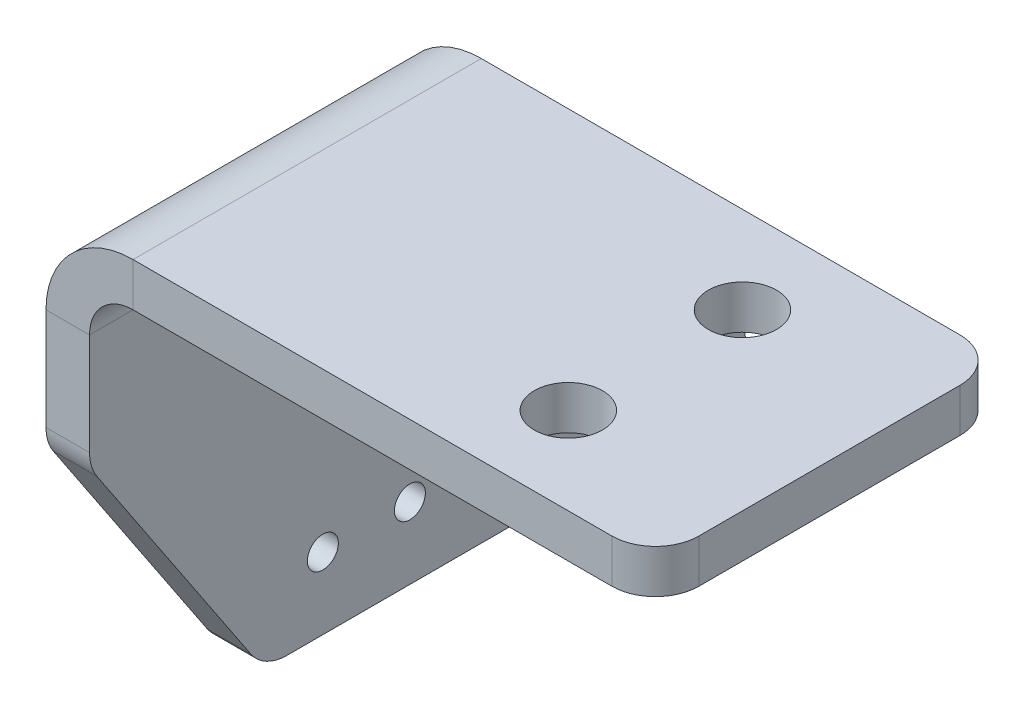
ISO-10303-21;
HEADER;
FILE_DESCRIPTION(('STEP AP214'),'2;1');
FILE_NAME('part.step','',(''),(''),'','','');
FILE_SCHEMA(('AUTOMOTIVE_DESIGN { 1 0 10303 214 1 1 1 1 }'));
ENDSEC;
DATA;
#1=APPLICATION_CONTEXT('core data for automotive mechanical design processes');
#2=APPLICATION_PROTOCOL_DEFINITION('international standard','automotive_design',2000,#1);
#3=PRODUCT_CONTEXT('',#1,'mechanical');
#4=PRODUCT('Part','Part','',(#3));
#5=PRODUCT_RELATED_PRODUCT_CATEGORY('part','',(#4));
#6=PRODUCT_DEFINITION_FORMATION('','',#4);
#7=PRODUCT_DEFINITION_CONTEXT('part definition',#1,'design');
#8=PRODUCT_DEFINITION('design','',#6,#7);
#9=PRODUCT_DEFINITION_SHAPE('','',#8);
#10=(LENGTH_UNIT() NAMED_UNIT(*) SI_UNIT(.MILLI.,.METRE.));
#11=(NAMED_UNIT(*) PLANE_ANGLE_UNIT() SI_UNIT($,.RADIAN.));
#12=(NAMED_UNIT(*) SI_UNIT($,.STERADIAN.) SOLID_ANGLE_UNIT());
#13=UNCERTAINTY_MEASURE_WITH_UNIT(LENGTH_MEASURE(1.E-05),#10,'distance_accuracy_value','');
#14=(GEOMETRIC_REPRESENTATION_CONTEXT(3) GLOBAL_UNCERTAINTY_ASSIGNED_CONTEXT((#13)) GLOBAL_UNIT_ASSIGNED_CONTEXT((#10,
#11,#12)) REPRESENTATION_CONTEXT('',''));
#15=CARTESIAN_POINT('',(0.,0.,0.));
#16=DIRECTION('',(0.,0.,1.));
#17=DIRECTION('',(1.,0.,0.));
#18=AXIS2_PLACEMENT_3D('',#15,#16,#17);
#19=CARTESIAN_POINT('',(-3.17500000000003,1.13091750636071,0.));
#20=DIRECTION('',(0.,0.,-1.));
#21=DIRECTION('',(0.,-1.,0.));
#22=AXIS2_PLACEMENT_3D('',#19,#20,#21);
#23=PLANE('',#22);
#24=DIRECTION('',(0.,-1.,0.));
#25=VECTOR('',#24,1.);
#26=CARTESIAN_POINT('',(-3.17500000000003,1.13091750636071,0.));
#27=LINE('',#26,#25);
#28=CARTESIAN_POINT('',(-3.17500000000002,-3.17500000000002,0.));
#29=VERTEX_POINT('',#28);
#30=CARTESIAN_POINT('',(-3.17499999999999,-10.6077698438402,0.));
#31=VERTEX_POINT('',#30);
#32=EDGE_CURVE('E200',#29,#31,#27,.T.);
#33=ORIENTED_EDGE('',*,*,#32,.T.);
#34=DIRECTION('',(1.,0.,0.));
#35=VECTOR('',#34,1.);
#36=CARTESIAN_POINT('',(-3.17499999999999,-10.6077698438402,0.));
#37=LINE('',#36,#35);
#38=CARTESIAN_POINT('',(0.,-10.6077698438402,0.));
#39=VERTEX_POINT('',#38);
#40=EDGE_CURVE('E289',#31,#39,#37,.T.);
#41=ORIENTED_EDGE('',*,*,#40,.T.);
#42=DIRECTION('',(0.,1.,0.));
#43=VECTOR('',#42,1.);
#44=CARTESIAN_POINT('',(0.,1.13091750636072,0.));
#45=LINE('',#44,#43);
#46=CARTESIAN_POINT('',(0.,-3.17500000000001,0.));
#47=VERTEX_POINT('',#46);
#48=EDGE_CURVE('E212',#47,#39,#45,.F.);
#49=ORIENTED_EDGE('',*,*,#48,.F.);
#50=DIRECTION('',(-1.,0.,0.));
#51=VECTOR('',#50,1.);
#52=CARTESIAN_POINT('',(-3.17500000000002,-3.17500000000002,0.));
#53=LINE('',#52,#51);
#54=EDGE_CURVE('E186',#47,#29,#53,.T.);
#55=ORIENTED_EDGE('',*,*,#54,.T.);
#56=EDGE_LOOP('',(#33,#41,#49,#55));
#57=FACE_BOUND('',#56,.T.);
#58=ADVANCED_FACE('F50',(#57),#23,.F.);
#59=CARTESIAN_POINT('',(-3.17500000000004,1.13091750636071,-25.4));
#60=DIRECTION('',(0.,0.,1.));
#61=DIRECTION('',(0.,1.,0.));
#62=AXIS2_PLACEMENT_3D('',#59,#60,#61);
#63=PLANE('',#62);
#64=DIRECTION('',(0.,1.,0.));
#65=VECTOR('',#64,1.);
#66=CARTESIAN_POINT('',(0.,1.13091750636072,-25.4));
#67=LINE('',#66,#65);
#68=CARTESIAN_POINT('',(0.,-18.5540824936393,-25.4));
#69=VERTEX_POINT('',#68);
#70=CARTESIAN_POINT('',(0.,-3.17500000000001,-25.4));
#71=VERTEX_POINT('',#70);
#72=EDGE_CURVE('E225',#69,#71,#67,.T.);
#73=ORIENTED_EDGE('',*,*,#72,.F.);
#74=DIRECTION('',(1.,0.,0.));
#75=VECTOR('',#74,1.);
#76=CARTESIAN_POINT('',(-3.17499999999997,-18.5540824936393,-25.4));
#77=LINE('',#76,#75);
#78=CARTESIAN_POINT('',(-3.17499999999997,-18.5540824936393,-25.4));
#79=VERTEX_POINT('',#78);
#80=EDGE_CURVE('E302',#69,#79,#77,.F.);
#81=ORIENTED_EDGE('',*,*,#80,.T.);
#82=DIRECTION('',(0.,1.,0.));
#83=VECTOR('',#82,1.);
#84=CARTESIAN_POINT('',(-3.17500000000004,1.13091750636071,-25.4));
#85=LINE('',#84,#83);
#86=CARTESIAN_POINT('',(-3.17500000000002,-3.17500000000002,-25.4));
#87=VERTEX_POINT('',#86);
#88=EDGE_CURVE('E187',#79,#87,#85,.T.);
#89=ORIENTED_EDGE('',*,*,#88,.T.);
#90=DIRECTION('',(1.,0.,0.));
#91=VECTOR('',#90,1.);
#92=CARTESIAN_POINT('',(-3.17500000000002,-3.17500000000002,-25.4));
#93=LINE('',#92,#91);
#94=EDGE_CURVE('E217',#87,#71,#93,.T.);
#95=ORIENTED_EDGE('',*,*,#94,.T.);
#96=EDGE_LOOP('',(#73,#81,#89,#95));
#97=FACE_BOUND('',#96,.T.);
#98=ADVANCED_FACE('F305',(#97),#63,.F.);
#99=CARTESIAN_POINT('',(-3.17500000000003,1.13091750636071,0.));
#100=DIRECTION('',(-1.,0.,0.));
#101=DIRECTION('',(0.,0.,1.));
#102=AXIS2_PLACEMENT_3D('',#99,#100,#101);
#103=PLANE('',#102);
#104=DIRECTION('',(0.,0.,-1.));
#105=VECTOR('',#104,1.);
#106=CARTESIAN_POINT('',(-3.17500000000016,-21.7290824936393,-25.4));
#107=LINE('',#106,#105);
#108=CARTESIAN_POINT('',(-3.17500000000016,-21.7290824936393,-28.575));
#109=VERTEX_POINT('',#108);
#110=CARTESIAN_POINT('',(-3.17500000000017,-21.7290824936393,-42.8795605736339));
#111=VERTEX_POINT('',#110);
#112=EDGE_CURVE('E315',#109,#111,#107,.T.);
#113=ORIENTED_EDGE('',*,*,#112,.T.);
#114=CARTESIAN_POINT('',(-3.17499999999995,-24.9040824936393,-42.8795605736339));
#115=DIRECTION('',(-1.,0.,0.));
#116=DIRECTION('',(0.,-1.,0.));
#117=AXIS2_PLACEMENT_3D('',#114,#115,#116);
#118=CIRCLE('',#117,3.175);
#119=CARTESIAN_POINT('',(-3.17499999999996,-23.0731133412636,-45.4734335394995));
#120=VERTEX_POINT('',#119);
#121=EDGE_CURVE('E297',#111,#120,#118,.T.);
#122=ORIENTED_EDGE('',*,*,#121,.T.);
#123=DIRECTION('',(0.,-0.816967863264762,-0.576683197598655));
#124=VECTOR('',#123,1.);
#125=CARTESIAN_POINT('',(-3.17500000000008,14.5055133493168,-18.9473441108545));
#126=LINE('',#125,#124);
#127=CARTESIAN_POINT('',(-3.17499999999995,-25.6131133412636,-47.2663747159701));
#128=VERTEX_POINT('',#127);
#129=EDGE_CURVE('E227',#120,#128,#126,.T.);
#130=ORIENTED_EDGE('',*,*,#129,.T.);
#131=CARTESIAN_POINT('',(-3.17499999999994,-27.4440824936393,-44.6725017501045));
#132=DIRECTION('',(-1.,0.,0.));
#133=DIRECTION('',(0.,-1.,0.));
#134=AXIS2_PLACEMENT_3D('',#131,#132,#133);
#135=CIRCLE('',#134,3.175);
#136=CARTESIAN_POINT('',(-3.17499999999993,-30.6190824936393,-44.6725017501045));
#137=VERTEX_POINT('',#136);
#138=EDGE_CURVE('E267',#128,#137,#135,.T.);
#139=ORIENTED_EDGE('',*,*,#138,.T.);
#140=DIRECTION('',(0.,0.,-1.));
#141=VECTOR('',#140,1.);
#142=CARTESIAN_POINT('',(-3.17499999999992,-30.6190824936393,0.));
#143=LINE('',#142,#141);
#144=CARTESIAN_POINT('',(-3.17499999999993,-30.6190824936393,-14.3992084331994));
#145=VERTEX_POINT('',#144);
#146=EDGE_CURVE('E378',#145,#137,#143,.T.);
#147=ORIENTED_EDGE('',*,*,#146,.F.);
#148=CARTESIAN_POINT('',(-3.17499999999994,-27.4440824936393,-14.3992084331994));
#149=DIRECTION('',(-1.,0.,0.));
#150=DIRECTION('',(0.,-1.,0.));
#151=AXIS2_PLACEMENT_3D('',#148,#149,#150);
#152=CIRCLE('',#151,3.175);
#153=CARTESIAN_POINT('',(-3.17499999999993,-29.2052556166544,-11.7574487486767));
#154=VERTEX_POINT('',#153);
#155=EDGE_CURVE('E265',#145,#154,#152,.T.);
#156=ORIENTED_EDGE('',*,*,#155,.T.);
#157=DIRECTION('',(0.,-0.832050294337843,-0.554700196225229));
#158=VECTOR('',#157,1.);
#159=CARTESIAN_POINT('',(-3.17500000000002,-2.77677480133161,5.86153846153847));
#160=LINE('',#159,#158);
#161=CARTESIAN_POINT('',(-3.17499999999999,-12.3689429668553,-0.533240315477345));
#162=VERTEX_POINT('',#161);
#163=EDGE_CURVE('E208',#162,#154,#160,.T.);
#164=ORIENTED_EDGE('',*,*,#163,.F.);
#165=CARTESIAN_POINT('',(-3.17499999999999,-10.6077698438402,-3.175));
#166=DIRECTION('',(-1.,0.,0.));
#167=DIRECTION('',(0.,-1.,0.));
#168=AXIS2_PLACEMENT_3D('',#165,#166,#167);
#169=CIRCLE('',#168,3.175);
#170=EDGE_CURVE('E205',#162,#31,#169,.T.);
#171=ORIENTED_EDGE('',*,*,#170,.T.);
#172=ORIENTED_EDGE('',*,*,#32,.F.);
#173=DIRECTION('',(0.,0.,-1.));
#174=VECTOR('',#173,1.);
#175=CARTESIAN_POINT('',(-3.17500000000002,-3.17500000000002,0.));
#176=LINE('',#175,#174);
#177=EDGE_CURVE('E175',#29,#87,#176,.T.);
#178=ORIENTED_EDGE('',*,*,#177,.T.);
#179=ORIENTED_EDGE('',*,*,#88,.F.);
#180=CARTESIAN_POINT('',(-3.17499999999997,-18.5540824936393,-28.575));
#181=DIRECTION('',(-1.,0.,0.));
#182=DIRECTION('',(0.,-1.,0.));
#183=AXIS2_PLACEMENT_3D('',#180,#181,#182);
#184=CIRCLE('',#183,3.175);
#185=EDGE_CURVE('E12',#79,#109,#184,.F.);
#186=ORIENTED_EDGE('',*,*,#185,.T.);
#187=EDGE_LOOP('',(#113,#122,#130,#139,#147,#156,#164,#171,#172,#178,#179,#186));
#188=FACE_BOUND('',#187,.T.);
#189=CARTESIAN_POINT('',(-3.17500000000012,-25.3999999999998,-17.018));
#190=DIRECTION('',(-1.,0.,0.));
#191=DIRECTION('',(0.,-1.,0.));
#192=AXIS2_PLACEMENT_3D('',#189,#190,#191);
#193=CIRCLE('',#192,1.1303);
#194=CARTESIAN_POINT('',(-3.17500000000013,-26.5302999999998,-17.018));
#195=VERTEX_POINT('',#194);
#196=EDGE_CURVE('E234',#195,#195,#193,.T.);
#197=ORIENTED_EDGE('',*,*,#196,.F.);
#198=EDGE_LOOP('',(#197));
#199=FACE_BOUND('',#198,.T.);
#200=CARTESIAN_POINT('',(-3.17500000000012,-25.3999999999998,-23.368));
#201=DIRECTION('',(-1.,0.,0.));
#202=DIRECTION('',(0.,-1.,0.));
#203=AXIS2_PLACEMENT_3D('',#200,#201,#202);
#204=CIRCLE('',#203,1.1303);
#205=CARTESIAN_POINT('',(-3.17500000000013,-26.5302999999998,-23.368));
#206=VERTEX_POINT('',#205);
#207=EDGE_CURVE('E324',#206,#206,#204,.T.);
#208=ORIENTED_EDGE('',*,*,#207,.F.);
#209=EDGE_LOOP('',(#208));
#210=FACE_BOUND('',#209,.T.);
#211=CARTESIAN_POINT('',(-3.17500000000012,-25.3999999999999,-29.718));
#212=DIRECTION('',(-1.,0.,0.));
#213=DIRECTION('',(0.,-1.,0.));
#214=AXIS2_PLACEMENT_3D('',#211,#212,#213);
#215=CIRCLE('',#214,1.1303);
#216=CARTESIAN_POINT('',(-3.17500000000013,-26.5302999999999,-29.718));
#217=VERTEX_POINT('',#216);
#218=EDGE_CURVE('E327',#217,#217,#215,.T.);
#219=ORIENTED_EDGE('',*,*,#218,.F.);
#220=EDGE_LOOP('',(#219));
#221=FACE_BOUND('',#220,.T.);
#222=CARTESIAN_POINT('',(-3.17500000000012,-25.3999999999999,-36.068));
#223=DIRECTION('',(-1.,0.,0.));
#224=DIRECTION('',(0.,-1.,0.));
#225=AXIS2_PLACEMENT_3D('',#222,#223,#224);
#226=CIRCLE('',#225,1.1303);
#227=CARTESIAN_POINT('',(-3.17500000000013,-26.5302999999999,-36.068));
#228=VERTEX_POINT('',#227);
#229=EDGE_CURVE('E330',#228,#228,#226,.T.);
#230=ORIENTED_EDGE('',*,*,#229,.F.);
#231=EDGE_LOOP('',(#230));
#232=FACE_BOUND('',#231,.T.);
#233=CARTESIAN_POINT('',(-3.17500000000012,-25.4,-42.418));
#234=DIRECTION('',(-1.,0.,0.));
#235=DIRECTION('',(0.,-1.,0.));
#236=AXIS2_PLACEMENT_3D('',#233,#234,#235);
#237=CIRCLE('',#236,1.1303);
#238=CARTESIAN_POINT('',(-3.17500000000013,-26.5303,-42.418));
#239=VERTEX_POINT('',#238);
#240=EDGE_CURVE('E319',#239,#239,#237,.T.);
#241=ORIENTED_EDGE('',*,*,#240,.F.);
#242=EDGE_LOOP('',(#241));
#243=FACE_BOUND('',#242,.T.);
#244=ADVANCED_FACE('F202',(#188,#199,#210,#221,#232,#243),#103,.T.);
#245=CARTESIAN_POINT('',(-3.17499999999992,-30.6190824936393,0.));
#246=DIRECTION('',(0.,1.,0.));
#247=DIRECTION('',(0.,0.,-1.));
#248=AXIS2_PLACEMENT_3D('',#245,#246,#247);
#249=PLANE('',#248);
#250=ORIENTED_EDGE('',*,*,#146,.T.);
#251=DIRECTION('',(-1.,0.,0.));
#252=VECTOR('',#251,1.);
#253=CARTESIAN_POINT('',(-3.17499999999993,-30.6190824936393,-44.6725017501045));
#254=LINE('',#253,#252);
#255=CARTESIAN_POINT('',(0.,-30.6190824936393,-44.6725017501045));
#256=VERTEX_POINT('',#255);
#257=EDGE_CURVE('E282',#137,#256,#254,.F.);
#258=ORIENTED_EDGE('',*,*,#257,.T.);
#259=DIRECTION('',(0.,0.,1.));
#260=VECTOR('',#259,1.);
#261=CARTESIAN_POINT('',(0.,-30.6190824936393,0.));
#262=LINE('',#261,#260);
#263=CARTESIAN_POINT('',(0.,-30.6190824936393,-14.3992084331994));
#264=VERTEX_POINT('',#263);
#265=EDGE_CURVE('E385',#264,#256,#262,.F.);
#266=ORIENTED_EDGE('',*,*,#265,.F.);
#267=DIRECTION('',(1.,0.,0.));
#268=VECTOR('',#267,1.);
#269=CARTESIAN_POINT('',(-3.17499999999993,-30.6190824936393,-14.3992084331994));
#270=LINE('',#269,#268);
#271=EDGE_CURVE('E279',#264,#145,#270,.F.);
#272=ORIENTED_EDGE('',*,*,#271,.T.);
#273=EDGE_LOOP('',(#250,#258,#266,#272));
#274=FACE_BOUND('',#273,.T.);
#275=ADVANCED_FACE('F397',(#274),#249,.F.);
#276=CARTESIAN_POINT('',(-3.17500000000002,-2.77677480133161,5.86153846153847));
#277=DIRECTION('',(0.,0.554700196225229,-0.832050294337843));
#278=DIRECTION('',(0.,-0.832050294337843,-0.554700196225229));
#279=AXIS2_PLACEMENT_3D('',#276,#277,#278);
#280=PLANE('',#279);
#281=ORIENTED_EDGE('',*,*,#163,.T.);
#282=DIRECTION('',(1.,0.,0.));
#283=VECTOR('',#282,1.);
#284=CARTESIAN_POINT('',(-3.17499999999993,-29.2052556166544,-11.7574487486767));
#285=LINE('',#284,#283);
#286=CARTESIAN_POINT('',(0.,-29.2052556166544,-11.7574487486767));
#287=VERTEX_POINT('',#286);
#288=EDGE_CURVE('E287',#154,#287,#285,.T.);
#289=ORIENTED_EDGE('',*,*,#288,.T.);
#290=DIRECTION('',(0.,-0.832050294337843,-0.554700196225229));
#291=VECTOR('',#290,1.);
#292=CARTESIAN_POINT('',(0.,-2.77677480133159,5.86153846153847));
#293=LINE('',#292,#291);
#294=CARTESIAN_POINT('',(0.,-12.3689429668553,-0.533240315477346));
#295=VERTEX_POINT('',#294);
#296=EDGE_CURVE('E228',#295,#287,#293,.T.);
#297=ORIENTED_EDGE('',*,*,#296,.F.);
#298=DIRECTION('',(1.,0.,0.));
#299=VECTOR('',#298,1.);
#300=CARTESIAN_POINT('',(-3.17499999999999,-12.3689429668553,-0.533240315477345));
#301=LINE('',#300,#299);
#302=EDGE_CURVE('E284',#295,#162,#301,.F.);
#303=ORIENTED_EDGE('',*,*,#302,.T.);
#304=EDGE_LOOP('',(#281,#289,#297,#303));
#305=FACE_BOUND('',#304,.T.);
#306=ADVANCED_FACE('F404',(#305),#280,.F.);
#307=CARTESIAN_POINT('',(-3.17500000000008,14.5055133493168,-18.9473441108545));
#308=DIRECTION('',(0.,0.576683197598655,-0.816967863264762));
#309=DIRECTION('',(0.,-0.816967863264762,-0.576683197598655));
#310=AXIS2_PLACEMENT_3D('',#307,#308,#309);
#311=PLANE('',#310);
#312=ORIENTED_EDGE('',*,*,#129,.F.);
#313=DIRECTION('',(-1.,0.,0.));
#314=VECTOR('',#313,1.);
#315=CARTESIAN_POINT('',(0.,-23.0731133412635,-45.4734335394995));
#316=LINE('',#315,#314);
#317=CARTESIAN_POINT('',(0.,-23.0731133412635,-45.4734335394995));
#318=VERTEX_POINT('',#317);
#319=EDGE_CURVE('E72',#120,#318,#316,.F.);
#320=ORIENTED_EDGE('',*,*,#319,.T.);
#321=DIRECTION('',(0.,-0.816967863264762,-0.576683197598655));
#322=VECTOR('',#321,1.);
#323=CARTESIAN_POINT('',(0.,14.5055133493168,-18.9473441108545));
#324=LINE('',#323,#322);
#325=CARTESIAN_POINT('',(0.,-25.6131133412636,-47.2663747159701));
#326=VERTEX_POINT('',#325);
#327=EDGE_CURVE('E343',#318,#326,#324,.T.);
#328=ORIENTED_EDGE('',*,*,#327,.T.);
#329=DIRECTION('',(1.,0.,0.));
#330=VECTOR('',#329,1.);
#331=CARTESIAN_POINT('',(-3.17499999999995,-25.6131133412636,-47.2663747159701));
#332=LINE('',#331,#330);
#333=EDGE_CURVE('E269',#326,#128,#332,.F.);
#334=ORIENTED_EDGE('',*,*,#333,.T.);
#335=EDGE_LOOP('',(#312,#320,#328,#334));
#336=FACE_BOUND('',#335,.T.);
#337=ADVANCED_FACE('F387',(#336),#311,.T.);
#338=CARTESIAN_POINT('',(0.,1.13091750636072,0.));
#339=DIRECTION('',(-1.,0.,0.));
#340=DIRECTION('',(0.,0.,1.));
#341=AXIS2_PLACEMENT_3D('',#338,#339,#340);
#342=PLANE('',#341);
#343=CARTESIAN_POINT('',(0.,-25.3999999999998,-17.018));
#344=DIRECTION('',(-1.,0.,0.));
#345=DIRECTION('',(0.,-1.,0.));
#346=AXIS2_PLACEMENT_3D('',#343,#344,#345);
#347=CIRCLE('',#346,1.1303);
#348=CARTESIAN_POINT('',(0.,-26.5302999999998,-17.018));
#349=VERTEX_POINT('',#348);
#350=EDGE_CURVE('E243',#349,#349,#347,.T.);
#351=ORIENTED_EDGE('',*,*,#350,.T.);
#352=EDGE_LOOP('',(#351));
#353=FACE_BOUND('',#352,.T.);
#354=CARTESIAN_POINT('',(0.,-25.3999999999999,-23.368));
#355=DIRECTION('',(-1.,0.,0.));
#356=DIRECTION('',(0.,-1.,0.));
#357=AXIS2_PLACEMENT_3D('',#354,#355,#356);
#358=CIRCLE('',#357,1.1303);
#359=CARTESIAN_POINT('',(0.,-26.5302999999999,-23.368));
#360=VERTEX_POINT('',#359);
#361=EDGE_CURVE('E240',#360,#360,#358,.T.);
#362=ORIENTED_EDGE('',*,*,#361,.T.);
#363=EDGE_LOOP('',(#362));
#364=FACE_BOUND('',#363,.T.);
#365=CARTESIAN_POINT('',(0.,-25.3999999999999,-29.718));
#366=DIRECTION('',(-1.,0.,0.));
#367=DIRECTION('',(0.,-1.,0.));
#368=AXIS2_PLACEMENT_3D('',#365,#366,#367);
#369=CIRCLE('',#368,1.1303);
#370=CARTESIAN_POINT('',(0.,-26.5302999999999,-29.718));
#371=VERTEX_POINT('',#370);
#372=EDGE_CURVE('E237',#371,#371,#369,.T.);
#373=ORIENTED_EDGE('',*,*,#372,.T.);
#374=EDGE_LOOP('',(#373));
#375=FACE_BOUND('',#374,.T.);
#376=CARTESIAN_POINT('',(0.,-25.3999999999999,-36.068));
#377=DIRECTION('',(-1.,0.,0.));
#378=DIRECTION('',(0.,-1.,0.));
#379=AXIS2_PLACEMENT_3D('',#376,#377,#378);
#380=CIRCLE('',#379,1.1303);
#381=CARTESIAN_POINT('',(0.,-26.5302999999999,-36.068));
#382=VERTEX_POINT('',#381);
#383=EDGE_CURVE('E233',#382,#382,#380,.T.);
#384=ORIENTED_EDGE('',*,*,#383,.T.);
#385=EDGE_LOOP('',(#384));
#386=FACE_BOUND('',#385,.T.);
#387=CARTESIAN_POINT('',(0.,-25.4,-42.418));
#388=DIRECTION('',(-1.,0.,0.));
#389=DIRECTION('',(0.,-1.,0.));
#390=AXIS2_PLACEMENT_3D('',#387,#388,#389);
#391=CIRCLE('',#390,1.1303);
#392=CARTESIAN_POINT('',(0.,-26.5303,-42.418));
#393=VERTEX_POINT('',#392);
#394=EDGE_CURVE('E230',#393,#393,#391,.T.);
#395=ORIENTED_EDGE('',*,*,#394,.T.);
#396=EDGE_LOOP('',(#395));
#397=FACE_BOUND('',#396,.T.);
#398=ORIENTED_EDGE('',*,*,#327,.F.);
#399=CARTESIAN_POINT('',(0.,-24.9040824936393,-42.8795605736339));
#400=DIRECTION('',(-1.,0.,0.));
#401=DIRECTION('',(0.,-1.,0.));
#402=AXIS2_PLACEMENT_3D('',#399,#400,#401);
#403=CIRCLE('',#402,3.175);
#404=CARTESIAN_POINT('',(0.,-21.7290824936393,-42.8795605736339));
#405=VERTEX_POINT('',#404);
#406=EDGE_CURVE('E300',#318,#405,#403,.F.);
#407=ORIENTED_EDGE('',*,*,#406,.T.);
#408=DIRECTION('',(0.,0.,-1.));
#409=VECTOR('',#408,1.);
#410=CARTESIAN_POINT('',(0.,-21.7290824936393,-25.4));
#411=LINE('',#410,#409);
#412=CARTESIAN_POINT('',(0.,-21.7290824936393,-28.575));
#413=VERTEX_POINT('',#412);
#414=EDGE_CURVE('E313',#413,#405,#411,.T.);
#415=ORIENTED_EDGE('',*,*,#414,.F.);
#416=CARTESIAN_POINT('',(0.,-18.5540824936393,-28.575));
#417=DIRECTION('',(-1.,0.,0.));
#418=DIRECTION('',(0.,-1.,0.));
#419=AXIS2_PLACEMENT_3D('',#416,#417,#418);
#420=CIRCLE('',#419,3.175);
#421=EDGE_CURVE('E58',#413,#69,#420,.T.);
#422=ORIENTED_EDGE('',*,*,#421,.T.);
#423=ORIENTED_EDGE('',*,*,#72,.T.);
#424=DIRECTION('',(0.,0.,-1.));
#425=VECTOR('',#424,1.);
#426=CARTESIAN_POINT('',(0.,-3.17500000000001,0.));
#427=LINE('',#426,#425);
#428=EDGE_CURVE('E214',#47,#71,#427,.T.);
#429=ORIENTED_EDGE('',*,*,#428,.F.);
#430=ORIENTED_EDGE('',*,*,#48,.T.);
#431=CARTESIAN_POINT('',(0.,-10.6077698438402,-3.175));
#432=DIRECTION('',(-1.,0.,0.));
#433=DIRECTION('',(0.,-1.,0.));
#434=AXIS2_PLACEMENT_3D('',#431,#432,#433);
#435=CIRCLE('',#434,3.175);
#436=EDGE_CURVE('E272',#39,#295,#435,.F.);
#437=ORIENTED_EDGE('',*,*,#436,.T.);
#438=ORIENTED_EDGE('',*,*,#296,.T.);
#439=CARTESIAN_POINT('',(0.,-27.4440824936393,-14.3992084331994));
#440=DIRECTION('',(-1.,0.,0.));
#441=DIRECTION('',(0.,-1.,0.));
#442=AXIS2_PLACEMENT_3D('',#439,#440,#441);
#443=CIRCLE('',#442,3.175);
#444=EDGE_CURVE('E274',#287,#264,#443,.F.);
#445=ORIENTED_EDGE('',*,*,#444,.T.);
#446=ORIENTED_EDGE('',*,*,#265,.T.);
#447=CARTESIAN_POINT('',(0.,-27.4440824936393,-44.6725017501045));
#448=DIRECTION('',(-1.,0.,0.));
#449=DIRECTION('',(0.,-1.,0.));
#450=AXIS2_PLACEMENT_3D('',#447,#448,#449);
#451=CIRCLE('',#450,3.175);
#452=EDGE_CURVE('E276',#256,#326,#451,.F.);
#453=ORIENTED_EDGE('',*,*,#452,.T.);
#454=EDGE_LOOP('',(#398,#407,#415,#422,#423,#429,#430,#437,#438,#445,#446,#453));
#455=FACE_BOUND('',#454,.T.);
#456=ADVANCED_FACE('F316',(#353,#364,#375,#386,#397,#455),#342,.F.);
#457=CARTESIAN_POINT('',(28.575,3.175,-6.35));
#458=DIRECTION('',(0.,1.,0.));
#459=DIRECTION('',(0.,0.,1.));
#460=AXIS2_PLACEMENT_3D('',#457,#458,#459);
#461=CYLINDRICAL_SURFACE('',#460,2.4892);
#462=CARTESIAN_POINT('',(28.575,3.175,-6.35));
#463=DIRECTION('',(0.,1.,0.));
#464=DIRECTION('',(0.,0.,1.));
#465=AXIS2_PLACEMENT_3D('',#462,#463,#464);
#466=CIRCLE('',#465,2.4892);
#467=CARTESIAN_POINT('',(28.575,3.175,-3.8608));
#468=VERTEX_POINT('',#467);
#469=EDGE_CURVE('E369',#468,#468,#466,.T.);
#470=ORIENTED_EDGE('',*,*,#469,.T.);
#471=EDGE_LOOP('',(#470));
#472=FACE_BOUND('',#471,.T.);
#473=CARTESIAN_POINT('',(28.575,0.,-6.35));
#474=DIRECTION('',(0.,1.,0.));
#475=DIRECTION('',(0.,0.,1.));
#476=AXIS2_PLACEMENT_3D('',#473,#474,#475);
#477=CIRCLE('',#476,2.4892);
#478=CARTESIAN_POINT('',(28.575,0.,-3.8608));
#479=VERTEX_POINT('',#478);
#480=EDGE_CURVE('E352',#479,#479,#477,.T.);
#481=ORIENTED_EDGE('',*,*,#480,.F.);
#482=EDGE_LOOP('',(#481));
#483=FACE_BOUND('',#482,.T.);
#484=ADVANCED_FACE('F464',(#472,#483),#461,.F.);
#485=CARTESIAN_POINT('',(28.575,3.175,-19.05));
#486=DIRECTION('',(0.,1.,0.));
#487=DIRECTION('',(0.,0.,1.));
#488=AXIS2_PLACEMENT_3D('',#485,#486,#487);
#489=CYLINDRICAL_SURFACE('',#488,2.4892);
#490=CARTESIAN_POINT('',(28.575,3.175,-19.05));
#491=DIRECTION('',(0.,1.,0.));
#492=DIRECTION('',(0.,0.,1.));
#493=AXIS2_PLACEMENT_3D('',#490,#491,#492);
#494=CIRCLE('',#493,2.4892);
#495=CARTESIAN_POINT('',(28.575,3.175,-16.5608));
#496=VERTEX_POINT('',#495);
#497=EDGE_CURVE('E366',#496,#496,#494,.T.);
#498=ORIENTED_EDGE('',*,*,#497,.T.);
#499=EDGE_LOOP('',(#498));
#500=FACE_BOUND('',#499,.T.);
#501=CARTESIAN_POINT('',(28.575,0.,-19.05));
#502=DIRECTION('',(0.,1.,0.));
#503=DIRECTION('',(0.,0.,1.));
#504=AXIS2_PLACEMENT_3D('',#501,#502,#503);
#505=CIRCLE('',#504,2.4892);
#506=CARTESIAN_POINT('',(28.575,0.,-16.5608));
#507=VERTEX_POINT('',#506);
#508=EDGE_CURVE('E355',#507,#507,#505,.T.);
#509=ORIENTED_EDGE('',*,*,#508,.F.);
#510=EDGE_LOOP('',(#509));
#511=FACE_BOUND('',#510,.T.);
#512=ADVANCED_FACE('F516',(#500,#511),#489,.F.);
#513=CARTESIAN_POINT('',(41.275,3.175,0.));
#514=DIRECTION('',(1.,0.,0.));
#515=DIRECTION('',(0.,0.,-1.));
#516=AXIS2_PLACEMENT_3D('',#513,#514,#515);
#517=PLANE('',#516);
#518=DIRECTION('',(0.,0.,-1.));
#519=VECTOR('',#518,1.);
#520=CARTESIAN_POINT('',(41.275,3.175,0.));
#521=LINE('',#520,#519);
#522=CARTESIAN_POINT('',(41.275,3.175,-3.175));
#523=VERTEX_POINT('',#522);
#524=CARTESIAN_POINT('',(41.275,3.175,-22.225));
#525=VERTEX_POINT('',#524);
#526=EDGE_CURVE('E360',#523,#525,#521,.T.);
#527=ORIENTED_EDGE('',*,*,#526,.F.);
#528=DIRECTION('',(0.,-1.,0.));
#529=VECTOR('',#528,1.);
#530=CARTESIAN_POINT('',(41.275,3.175,-3.175));
#531=LINE('',#530,#529);
#532=CARTESIAN_POINT('',(41.275,0.,-3.175));
#533=VERTEX_POINT('',#532);
#534=EDGE_CURVE('E256',#523,#533,#531,.T.);
#535=ORIENTED_EDGE('',*,*,#534,.T.);
#536=DIRECTION('',(0.,0.,1.));
#537=VECTOR('',#536,1.);
#538=CARTESIAN_POINT('',(41.275,0.,0.));
#539=LINE('',#538,#537);
#540=CARTESIAN_POINT('',(41.275,0.,-22.225));
#541=VERTEX_POINT('',#540);
#542=EDGE_CURVE('E363',#533,#541,#539,.F.);
#543=ORIENTED_EDGE('',*,*,#542,.T.);
#544=DIRECTION('',(0.,-1.,0.));
#545=VECTOR('',#544,1.);
#546=CARTESIAN_POINT('',(41.275,3.175,-22.225));
#547=LINE('',#546,#545);
#548=EDGE_CURVE('E253',#541,#525,#547,.F.);
#549=ORIENTED_EDGE('',*,*,#548,.T.);
#550=EDGE_LOOP('',(#527,#535,#543,#549));
#551=FACE_BOUND('',#550,.T.);
#552=ADVANCED_FACE('F431',(#551),#517,.T.);
#553=CARTESIAN_POINT('',(0.,3.175,0.));
#554=DIRECTION('',(0.,1.,0.));
#555=DIRECTION('',(0.,0.,1.));
#556=AXIS2_PLACEMENT_3D('',#553,#554,#555);
#557=PLANE('',#556);
#558=DIRECTION('',(-1.,0.,0.));
#559=VECTOR('',#558,1.);
#560=CARTESIAN_POINT('',(0.,3.175,0.));
#561=LINE('',#560,#559);
#562=CARTESIAN_POINT('',(38.1,3.175,0.));
#563=VERTEX_POINT('',#562);
#564=CARTESIAN_POINT('',(3.17499999999998,3.175,0.));
#565=VERTEX_POINT('',#564);
#566=EDGE_CURVE('E358',#563,#565,#561,.T.);
#567=ORIENTED_EDGE('',*,*,#566,.F.);
#568=CARTESIAN_POINT('',(38.1,3.175,-3.175));
#569=DIRECTION('',(0.,1.,0.));
#570=DIRECTION('',(0.,0.,1.));
#571=AXIS2_PLACEMENT_3D('',#568,#569,#570);
#572=CIRCLE('',#571,3.175);
#573=EDGE_CURVE('E251',#563,#523,#572,.T.);
#574=ORIENTED_EDGE('',*,*,#573,.T.);
#575=ORIENTED_EDGE('',*,*,#526,.T.);
#576=CARTESIAN_POINT('',(38.1,3.175,-22.225));
#577=DIRECTION('',(0.,1.,0.));
#578=DIRECTION('',(0.,0.,1.));
#579=AXIS2_PLACEMENT_3D('',#576,#577,#578);
#580=CIRCLE('',#579,3.175);
#581=CARTESIAN_POINT('',(38.1,3.175,-25.4));
#582=VERTEX_POINT('',#581);
#583=EDGE_CURVE('E249',#525,#582,#580,.T.);
#584=ORIENTED_EDGE('',*,*,#583,.T.);
#585=DIRECTION('',(1.,0.,0.));
#586=VECTOR('',#585,1.);
#587=CARTESIAN_POINT('',(0.,3.175,-25.4));
#588=LINE('',#587,#586);
#589=CARTESIAN_POINT('',(3.17499999999998,3.175,-25.4));
#590=VERTEX_POINT('',#589);
#591=EDGE_CURVE('E340',#590,#582,#588,.T.);
#592=ORIENTED_EDGE('',*,*,#591,.F.);
#593=DIRECTION('',(0.,0.,-1.));
#594=VECTOR('',#593,1.);
#595=CARTESIAN_POINT('',(3.17499999999998,3.175,0.));
#596=LINE('',#595,#594);
#597=EDGE_CURVE('E336',#565,#590,#596,.T.);
#598=ORIENTED_EDGE('',*,*,#597,.F.);
#599=EDGE_LOOP('',(#567,#574,#575,#584,#592,#598));
#600=FACE_BOUND('',#599,.T.);
#601=ORIENTED_EDGE('',*,*,#497,.F.);
#602=EDGE_LOOP('',(#601));
#603=FACE_BOUND('',#602,.T.);
#604=ORIENTED_EDGE('',*,*,#469,.F.);
#605=EDGE_LOOP('',(#604));
#606=FACE_BOUND('',#605,.T.);
#607=ADVANCED_FACE('F423',(#600,#603,#606),#557,.T.);
#608=CARTESIAN_POINT('',(0.,3.175,0.));
#609=DIRECTION('',(0.,0.,-1.));
#610=DIRECTION('',(-1.,0.,0.));
#611=AXIS2_PLACEMENT_3D('',#608,#609,#610);
#612=PLANE('',#611);
#613=DIRECTION('',(1.,0.,0.));
#614=VECTOR('',#613,1.);
#615=CARTESIAN_POINT('',(0.,0.,0.));
#616=LINE('',#615,#614);
#617=CARTESIAN_POINT('',(38.1,0.,0.));
#618=VERTEX_POINT('',#617);
#619=CARTESIAN_POINT('',(3.17499999999998,0.,0.));
#620=VERTEX_POINT('',#619);
#621=EDGE_CURVE('E350',#618,#620,#616,.F.);
#622=ORIENTED_EDGE('',*,*,#621,.F.);
#623=DIRECTION('',(0.,1.,0.));
#624=VECTOR('',#623,1.);
#625=CARTESIAN_POINT('',(38.1,3.175,0.));
#626=LINE('',#625,#624);
#627=EDGE_CURVE('E223',#618,#563,#626,.T.);
#628=ORIENTED_EDGE('',*,*,#627,.T.);
#629=ORIENTED_EDGE('',*,*,#566,.T.);
#630=DIRECTION('',(0.,1.,0.));
#631=VECTOR('',#630,1.);
#632=CARTESIAN_POINT('',(3.17499999999998,3.175,0.));
#633=LINE('',#632,#631);
#634=EDGE_CURVE('E196',#620,#565,#633,.T.);
#635=ORIENTED_EDGE('',*,*,#634,.F.);
#636=EDGE_LOOP('',(#622,#628,#629,#635));
#637=FACE_BOUND('',#636,.T.);
#638=ADVANCED_FACE('F442',(#637),#612,.F.);
#639=CARTESIAN_POINT('',(0.,0.,0.));
#640=DIRECTION('',(0.,1.,0.));
#641=DIRECTION('',(0.,0.,1.));
#642=AXIS2_PLACEMENT_3D('',#639,#640,#641);
#643=PLANE('',#642);
#644=ORIENTED_EDGE('',*,*,#508,.T.);
#645=EDGE_LOOP('',(#644));
#646=FACE_BOUND('',#645,.T.);
#647=ORIENTED_EDGE('',*,*,#480,.T.);
#648=EDGE_LOOP('',(#647));
#649=FACE_BOUND('',#648,.T.);
#650=ORIENTED_EDGE('',*,*,#542,.F.);
#651=CARTESIAN_POINT('',(38.1,0.,-3.175));
#652=DIRECTION('',(0.,1.,0.));
#653=DIRECTION('',(0.,0.,1.));
#654=AXIS2_PLACEMENT_3D('',#651,#652,#653);
#655=CIRCLE('',#654,3.175);
#656=EDGE_CURVE('E260',#533,#618,#655,.F.);
#657=ORIENTED_EDGE('',*,*,#656,.T.);
#658=ORIENTED_EDGE('',*,*,#621,.T.);
#659=DIRECTION('',(0.,0.,-1.));
#660=VECTOR('',#659,1.);
#661=CARTESIAN_POINT('',(3.17499999999998,0.,0.));
#662=LINE('',#661,#660);
#663=CARTESIAN_POINT('',(3.17499999999998,0.,-25.4));
#664=VERTEX_POINT('',#663);
#665=EDGE_CURVE('E347',#620,#664,#662,.T.);
#666=ORIENTED_EDGE('',*,*,#665,.T.);
#667=DIRECTION('',(1.,0.,0.));
#668=VECTOR('',#667,1.);
#669=CARTESIAN_POINT('',(0.,0.,-25.4));
#670=LINE('',#669,#668);
#671=CARTESIAN_POINT('',(38.1,0.,-25.4));
#672=VERTEX_POINT('',#671);
#673=EDGE_CURVE('E344',#664,#672,#670,.T.);
#674=ORIENTED_EDGE('',*,*,#673,.T.);
#675=CARTESIAN_POINT('',(38.1,0.,-22.225));
#676=DIRECTION('',(0.,1.,0.));
#677=DIRECTION('',(0.,0.,1.));
#678=AXIS2_PLACEMENT_3D('',#675,#676,#677);
#679=CIRCLE('',#678,3.175);
#680=EDGE_CURVE('E258',#672,#541,#679,.F.);
#681=ORIENTED_EDGE('',*,*,#680,.T.);
#682=EDGE_LOOP('',(#650,#657,#658,#666,#674,#681));
#683=FACE_BOUND('',#682,.T.);
#684=ADVANCED_FACE('F436',(#646,#649,#683),#643,.F.);
#685=CARTESIAN_POINT('',(0.,3.175,-25.4));
#686=DIRECTION('',(0.,0.,1.));
#687=DIRECTION('',(1.,0.,0.));
#688=AXIS2_PLACEMENT_3D('',#685,#686,#687);
#689=PLANE('',#688);
#690=ORIENTED_EDGE('',*,*,#591,.T.);
#691=DIRECTION('',(0.,1.,0.));
#692=VECTOR('',#691,1.);
#693=CARTESIAN_POINT('',(38.1,3.175,-25.4));
#694=LINE('',#693,#692);
#695=EDGE_CURVE('E262',#582,#672,#694,.F.);
#696=ORIENTED_EDGE('',*,*,#695,.T.);
#697=ORIENTED_EDGE('',*,*,#673,.F.);
#698=DIRECTION('',(0.,-1.,0.));
#699=VECTOR('',#698,1.);
#700=CARTESIAN_POINT('',(3.17499999999998,3.175,-25.4));
#701=LINE('',#700,#699);
#702=EDGE_CURVE('E373',#590,#664,#701,.T.);
#703=ORIENTED_EDGE('',*,*,#702,.F.);
#704=EDGE_LOOP('',(#690,#696,#697,#703));
#705=FACE_BOUND('',#704,.T.);
#706=ADVANCED_FACE('F418',(#705),#689,.F.);
#707=CARTESIAN_POINT('',(3.17499999999998,-3.175,0.));
#708=DIRECTION('',(0.,0.,1.));
#709=DIRECTION('',(1.,0.,0.));
#710=AXIS2_PLACEMENT_3D('',#707,#708,#709);
#711=PLANE('',#710);
#712=ORIENTED_EDGE('',*,*,#54,.F.);
#713=CARTESIAN_POINT('',(3.17499999999998,-3.175,0.));
#714=DIRECTION('',(0.,0.,1.));
#715=DIRECTION('',(1.,0.,0.));
#716=AXIS2_PLACEMENT_3D('',#713,#714,#715);
#717=CIRCLE('',#716,3.175);
#718=EDGE_CURVE('E246',#47,#620,#717,.F.);
#719=ORIENTED_EDGE('',*,*,#718,.T.);
#720=ORIENTED_EDGE('',*,*,#634,.T.);
#721=CARTESIAN_POINT('',(3.17499999999998,-3.175,0.));
#722=DIRECTION('',(0.,0.,-1.));
#723=DIRECTION('',(1.,0.,0.));
#724=AXIS2_PLACEMENT_3D('',#721,#722,#723);
#725=CIRCLE('',#724,6.35);
#726=EDGE_CURVE('E179',#29,#565,#725,.T.);
#727=ORIENTED_EDGE('',*,*,#726,.F.);
#728=EDGE_LOOP('',(#712,#719,#720,#727));
#729=FACE_BOUND('',#728,.T.);
#730=ADVANCED_FACE('F191',(#729),#711,.T.);
#731=CARTESIAN_POINT('',(3.17499999999998,-3.175,-25.4));
#732=DIRECTION('',(0.,0.,-1.));
#733=DIRECTION('',(0.,1.,0.));
#734=AXIS2_PLACEMENT_3D('',#731,#732,#733);
#735=PLANE('',#734);
#736=CARTESIAN_POINT('',(3.17499999999998,-3.175,-25.4));
#737=DIRECTION('',(0.,0.,1.));
#738=DIRECTION('',(1.,0.,0.));
#739=AXIS2_PLACEMENT_3D('',#736,#737,#738);
#740=CIRCLE('',#739,3.175);
#741=EDGE_CURVE('E197',#664,#71,#740,.T.);
#742=ORIENTED_EDGE('',*,*,#741,.T.);
#743=ORIENTED_EDGE('',*,*,#94,.F.);
#744=CARTESIAN_POINT('',(3.17499999999998,-3.175,-25.4));
#745=DIRECTION('',(0.,0.,1.));
#746=DIRECTION('',(0.,1.,0.));
#747=AXIS2_PLACEMENT_3D('',#744,#745,#746);
#748=CIRCLE('',#747,6.35);
#749=EDGE_CURVE('E181',#590,#87,#748,.T.);
#750=ORIENTED_EDGE('',*,*,#749,.F.);
#751=ORIENTED_EDGE('',*,*,#702,.T.);
#752=EDGE_LOOP('',(#742,#743,#750,#751));
#753=FACE_BOUND('',#752,.T.);
#754=ADVANCED_FACE('F415',(#753),#735,.T.);
#755=CARTESIAN_POINT('',(3.17499999999997,-3.175,-39.3684223706048));
#756=DIRECTION('',(0.,0.,1.));
#757=DIRECTION('',(1.,0.,0.));
#758=AXIS2_PLACEMENT_3D('',#755,#756,#757);
#759=CYLINDRICAL_SURFACE('',#758,6.35);
#760=ORIENTED_EDGE('',*,*,#597,.T.);
#761=ORIENTED_EDGE('',*,*,#749,.T.);
#762=ORIENTED_EDGE('',*,*,#177,.F.);
#763=ORIENTED_EDGE('',*,*,#726,.T.);
#764=EDGE_LOOP('',(#760,#761,#762,#763));
#765=FACE_BOUND('',#764,.T.);
#766=ADVANCED_FACE('F178',(#765),#759,.T.);
#767=CARTESIAN_POINT('',(3.17499999999997,-3.175,-39.3684223706048));
#768=DIRECTION('',(0.,0.,1.));
#769=DIRECTION('',(1.,0.,0.));
#770=AXIS2_PLACEMENT_3D('',#767,#768,#769);
#771=CYLINDRICAL_SURFACE('',#770,3.175);
#772=ORIENTED_EDGE('',*,*,#665,.F.);
#773=ORIENTED_EDGE('',*,*,#718,.F.);
#774=ORIENTED_EDGE('',*,*,#428,.T.);
#775=ORIENTED_EDGE('',*,*,#741,.F.);
#776=EDGE_LOOP('',(#772,#773,#774,#775));
#777=FACE_BOUND('',#776,.T.);
#778=ADVANCED_FACE('F413',(#777),#771,.F.);
#779=CARTESIAN_POINT('',(41.275,-25.4000000000001,-42.418));
#780=DIRECTION('',(-1.,0.,0.));
#781=DIRECTION('',(0.,-1.,0.));
#782=AXIS2_PLACEMENT_3D('',#779,#780,#781);
#783=CYLINDRICAL_SURFACE('',#782,1.1303);
#784=ORIENTED_EDGE('',*,*,#240,.T.);
#785=EDGE_LOOP('',(#784));
#786=FACE_BOUND('',#785,.T.);
#787=ORIENTED_EDGE('',*,*,#394,.F.);
#788=EDGE_LOOP('',(#787));
#789=FACE_BOUND('',#788,.T.);
#790=ADVANCED_FACE('F501',(#786,#789),#783,.F.);
#791=CARTESIAN_POINT('',(41.275,-25.4000000000001,-36.068));
#792=DIRECTION('',(-1.,0.,0.));
#793=DIRECTION('',(0.,-1.,0.));
#794=AXIS2_PLACEMENT_3D('',#791,#792,#793);
#795=CYLINDRICAL_SURFACE('',#794,1.1303);
#796=ORIENTED_EDGE('',*,*,#229,.T.);
#797=EDGE_LOOP('',(#796));
#798=FACE_BOUND('',#797,.T.);
#799=ORIENTED_EDGE('',*,*,#383,.F.);
#800=EDGE_LOOP('',(#799));
#801=FACE_BOUND('',#800,.T.);
#802=ADVANCED_FACE('F497',(#798,#801),#795,.F.);
#803=CARTESIAN_POINT('',(41.275,-25.4,-29.718));
#804=DIRECTION('',(-1.,0.,0.));
#805=DIRECTION('',(0.,-1.,0.));
#806=AXIS2_PLACEMENT_3D('',#803,#804,#805);
#807=CYLINDRICAL_SURFACE('',#806,1.1303);
#808=ORIENTED_EDGE('',*,*,#218,.T.);
#809=EDGE_LOOP('',(#808));
#810=FACE_BOUND('',#809,.T.);
#811=ORIENTED_EDGE('',*,*,#372,.F.);
#812=EDGE_LOOP('',(#811));
#813=FACE_BOUND('',#812,.T.);
#814=ADVANCED_FACE('F493',(#810,#813),#807,.F.);
#815=CARTESIAN_POINT('',(41.275,-25.4,-23.368));
#816=DIRECTION('',(-1.,0.,0.));
#817=DIRECTION('',(0.,-1.,0.));
#818=AXIS2_PLACEMENT_3D('',#815,#816,#817);
#819=CYLINDRICAL_SURFACE('',#818,1.1303);
#820=ORIENTED_EDGE('',*,*,#207,.T.);
#821=EDGE_LOOP('',(#820));
#822=FACE_BOUND('',#821,.T.);
#823=ORIENTED_EDGE('',*,*,#361,.F.);
#824=EDGE_LOOP('',(#823));
#825=FACE_BOUND('',#824,.T.);
#826=ADVANCED_FACE('F489',(#822,#825),#819,.F.);
#827=CARTESIAN_POINT('',(41.275,-25.4,-17.018));
#828=DIRECTION('',(-1.,0.,0.));
#829=DIRECTION('',(0.,-1.,0.));
#830=AXIS2_PLACEMENT_3D('',#827,#828,#829);
#831=CYLINDRICAL_SURFACE('',#830,1.1303);
#832=ORIENTED_EDGE('',*,*,#196,.T.);
#833=EDGE_LOOP('',(#832));
#834=FACE_BOUND('',#833,.T.);
#835=ORIENTED_EDGE('',*,*,#350,.F.);
#836=EDGE_LOOP('',(#835));
#837=FACE_BOUND('',#836,.T.);
#838=ADVANCED_FACE('F469',(#834,#837),#831,.F.);
#839=CARTESIAN_POINT('',(38.1,3.175,-3.175));
#840=DIRECTION('',(0.,-1.,0.));
#841=DIRECTION('',(0.,0.,-1.));
#842=AXIS2_PLACEMENT_3D('',#839,#840,#841);
#843=CYLINDRICAL_SURFACE('',#842,3.175);
#844=ORIENTED_EDGE('',*,*,#656,.F.);
#845=ORIENTED_EDGE('',*,*,#534,.F.);
#846=ORIENTED_EDGE('',*,*,#573,.F.);
#847=ORIENTED_EDGE('',*,*,#627,.F.);
#848=EDGE_LOOP('',(#844,#845,#846,#847));
#849=FACE_BOUND('',#848,.T.);
#850=ADVANCED_FACE('F440',(#849),#843,.T.);
#851=CARTESIAN_POINT('',(38.1,3.175,-22.225));
#852=DIRECTION('',(0.,-1.,0.));
#853=DIRECTION('',(0.,0.,-1.));
#854=AXIS2_PLACEMENT_3D('',#851,#852,#853);
#855=CYLINDRICAL_SURFACE('',#854,3.175);
#856=ORIENTED_EDGE('',*,*,#680,.F.);
#857=ORIENTED_EDGE('',*,*,#695,.F.);
#858=ORIENTED_EDGE('',*,*,#583,.F.);
#859=ORIENTED_EDGE('',*,*,#548,.F.);
#860=EDGE_LOOP('',(#856,#857,#858,#859));
#861=FACE_BOUND('',#860,.T.);
#862=ADVANCED_FACE('F429',(#861),#855,.T.);
#863=CARTESIAN_POINT('',(-3.17499999999994,-27.4440824936393,-44.6725017501045));
#864=DIRECTION('',(1.,0.,0.));
#865=DIRECTION('',(0.,1.,0.));
#866=AXIS2_PLACEMENT_3D('',#863,#864,#865);
#867=CYLINDRICAL_SURFACE('',#866,3.175);
#868=ORIENTED_EDGE('',*,*,#452,.F.);
#869=ORIENTED_EDGE('',*,*,#257,.F.);
#870=ORIENTED_EDGE('',*,*,#138,.F.);
#871=ORIENTED_EDGE('',*,*,#333,.F.);
#872=EDGE_LOOP('',(#868,#869,#870,#871));
#873=FACE_BOUND('',#872,.T.);
#874=ADVANCED_FACE('F394',(#873),#867,.T.);
#875=CARTESIAN_POINT('',(-3.17499999999994,-27.4440824936393,-14.3992084331994));
#876=DIRECTION('',(-1.,0.,0.));
#877=DIRECTION('',(0.,-1.,0.));
#878=AXIS2_PLACEMENT_3D('',#875,#876,#877);
#879=CYLINDRICAL_SURFACE('',#878,3.175);
#880=ORIENTED_EDGE('',*,*,#444,.F.);
#881=ORIENTED_EDGE('',*,*,#288,.F.);
#882=ORIENTED_EDGE('',*,*,#155,.F.);
#883=ORIENTED_EDGE('',*,*,#271,.F.);
#884=EDGE_LOOP('',(#880,#881,#882,#883));
#885=FACE_BOUND('',#884,.T.);
#886=ADVANCED_FACE('F401',(#885),#879,.T.);
#887=CARTESIAN_POINT('',(-3.17499999999999,-10.6077698438402,-3.175));
#888=DIRECTION('',(-1.,0.,0.));
#889=DIRECTION('',(0.,-1.,0.));
#890=AXIS2_PLACEMENT_3D('',#887,#888,#889);
#891=CYLINDRICAL_SURFACE('',#890,3.175);
#892=ORIENTED_EDGE('',*,*,#436,.F.);
#893=ORIENTED_EDGE('',*,*,#40,.F.);
#894=ORIENTED_EDGE('',*,*,#170,.F.);
#895=ORIENTED_EDGE('',*,*,#302,.F.);
#896=EDGE_LOOP('',(#892,#893,#894,#895));
#897=FACE_BOUND('',#896,.T.);
#898=ADVANCED_FACE('F409',(#897),#891,.T.);
#899=CARTESIAN_POINT('',(-3.17500000000016,-21.7290824936393,-25.4));
#900=DIRECTION('',(0.,-1.,0.));
#901=DIRECTION('',(1.,0.,0.));
#902=AXIS2_PLACEMENT_3D('',#899,#900,#901);
#903=PLANE('',#902);
#904=ORIENTED_EDGE('',*,*,#414,.T.);
#905=DIRECTION('',(-1.,0.,0.));
#906=VECTOR('',#905,1.);
#907=CARTESIAN_POINT('',(-3.17500000000017,-21.7290824936393,-42.8795605736339));
#908=LINE('',#907,#906);
#909=EDGE_CURVE('E294',#405,#111,#908,.T.);
#910=ORIENTED_EDGE('',*,*,#909,.T.);
#911=ORIENTED_EDGE('',*,*,#112,.F.);
#912=DIRECTION('',(-1.,0.,0.));
#913=VECTOR('',#912,1.);
#914=CARTESIAN_POINT('',(-3.17500000000016,-21.7290824936393,-28.575));
#915=LINE('',#914,#913);
#916=EDGE_CURVE('E291',#109,#413,#915,.F.);
#917=ORIENTED_EDGE('',*,*,#916,.T.);
#918=EDGE_LOOP('',(#904,#910,#911,#917));
#919=FACE_BOUND('',#918,.T.);
#920=ADVANCED_FACE('F312',(#919),#903,.F.);
#921=CARTESIAN_POINT('',(-3.17500000000015,-24.9040824936393,-42.8795605736339));
#922=DIRECTION('',(1.,0.,0.));
#923=DIRECTION('',(0.,1.,0.));
#924=AXIS2_PLACEMENT_3D('',#921,#922,#923);
#925=CYLINDRICAL_SURFACE('',#924,3.175);
#926=ORIENTED_EDGE('',*,*,#406,.F.);
#927=ORIENTED_EDGE('',*,*,#319,.F.);
#928=ORIENTED_EDGE('',*,*,#121,.F.);
#929=ORIENTED_EDGE('',*,*,#909,.F.);
#930=EDGE_LOOP('',(#926,#927,#928,#929));
#931=FACE_BOUND('',#930,.T.);
#932=ADVANCED_FACE('F477',(#931),#925,.T.);
#933=CARTESIAN_POINT('',(-3.17500000000018,-18.5540824936393,-28.575));
#934=DIRECTION('',(-1.,0.,0.));
#935=DIRECTION('',(0.,-1.,0.));
#936=AXIS2_PLACEMENT_3D('',#933,#934,#935);
#937=CYLINDRICAL_SURFACE('',#936,3.175);
#938=ORIENTED_EDGE('',*,*,#185,.F.);
#939=ORIENTED_EDGE('',*,*,#80,.F.);
#940=ORIENTED_EDGE('',*,*,#421,.F.);
#941=ORIENTED_EDGE('',*,*,#916,.F.);
#942=EDGE_LOOP('',(#938,#939,#940,#941));
#943=FACE_BOUND('',#942,.T.);
#944=ADVANCED_FACE('F52',(#943),#937,.F.);
#945=CLOSED_SHELL('',(#58,#98,#244,#275,#306,#337,#456,#484,#512,#552,#607,#638,#684,#706,#730,
#754,#766,#778,#790,#802,#814,#826,#838,#850,#862,#874,#886,#898,#920,#932,#944));
#946=MANIFOLD_SOLID_BREP('B2',#945);
#947=ADVANCED_BREP_SHAPE_REPRESENTATION('',(#18,#946),#14);
#948=SHAPE_DEFINITION_REPRESENTATION(#9,#947);
ENDSEC;
END-ISO-10303-21;
